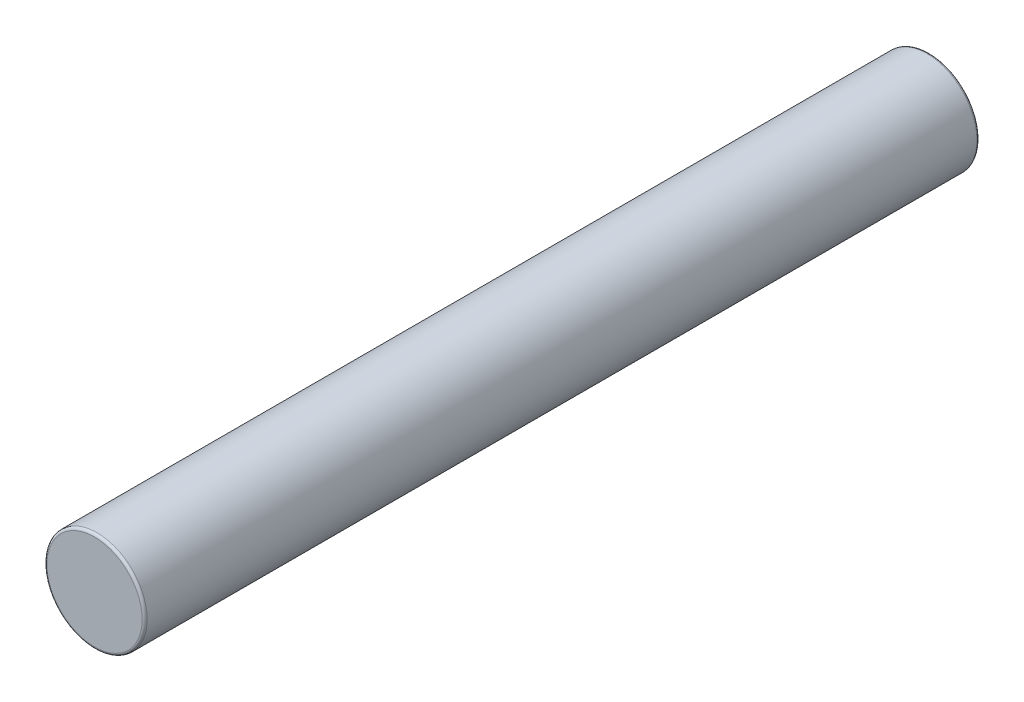
ISO-10303-21;
HEADER;
FILE_DESCRIPTION(('STEP AP214'),'2;1');
FILE_NAME('part.step','',(''),(''),'','','');
FILE_SCHEMA(('AUTOMOTIVE_DESIGN { 1 0 10303 214 1 1 1 1 }'));
ENDSEC;
DATA;
#1=APPLICATION_CONTEXT('core data for automotive mechanical design processes');
#2=APPLICATION_PROTOCOL_DEFINITION('international standard','automotive_design',2000,#1);
#3=PRODUCT_CONTEXT('',#1,'mechanical');
#4=PRODUCT('Part','Part','',(#3));
#5=PRODUCT_RELATED_PRODUCT_CATEGORY('part','',(#4));
#6=PRODUCT_DEFINITION_FORMATION('','',#4);
#7=PRODUCT_DEFINITION_CONTEXT('part definition',#1,'design');
#8=PRODUCT_DEFINITION('design','',#6,#7);
#9=PRODUCT_DEFINITION_SHAPE('','',#8);
#10=(LENGTH_UNIT() NAMED_UNIT(*) SI_UNIT(.MILLI.,.METRE.));
#11=(NAMED_UNIT(*) PLANE_ANGLE_UNIT() SI_UNIT($,.RADIAN.));
#12=(NAMED_UNIT(*) SI_UNIT($,.STERADIAN.) SOLID_ANGLE_UNIT());
#13=UNCERTAINTY_MEASURE_WITH_UNIT(LENGTH_MEASURE(1.E-05),#10,'distance_accuracy_value','');
#14=(GEOMETRIC_REPRESENTATION_CONTEXT(3) GLOBAL_UNCERTAINTY_ASSIGNED_CONTEXT((#13)) GLOBAL_UNIT_ASSIGNED_CONTEXT((#10,
#11,#12)) REPRESENTATION_CONTEXT('',''));
#15=CARTESIAN_POINT('',(0.,0.,0.));
#16=DIRECTION('',(0.,0.,1.));
#17=DIRECTION('',(1.,0.,0.));
#18=AXIS2_PLACEMENT_3D('',#15,#16,#17);
#19=CARTESIAN_POINT('',(0.,0.,-25.));
#20=DIRECTION('',(0.,0.,1.));
#21=DIRECTION('',(1.,0.,0.));
#22=AXIS2_PLACEMENT_3D('',#19,#20,#21);
#23=CYLINDRICAL_SURFACE('',#22,1.5);
#24=CARTESIAN_POINT('',(0.,0.,-0.0749999999999987));
#25=DIRECTION('',(0.,0.,1.));
#26=DIRECTION('',(1.,0.,0.));
#27=AXIS2_PLACEMENT_3D('',#24,#25,#26);
#28=CIRCLE('',#27,1.5);
#29=CARTESIAN_POINT('',(1.5,0.,-0.0749999999999987));
#30=VERTEX_POINT('',#29);
#31=EDGE_CURVE('E47',#30,#30,#28,.F.);
#32=ORIENTED_EDGE('',*,*,#31,.T.);
#33=EDGE_LOOP('',(#32));
#34=FACE_BOUND('',#33,.T.);
#35=CARTESIAN_POINT('',(0.,0.,-24.925));
#36=DIRECTION('',(0.,0.,1.));
#37=DIRECTION('',(1.,0.,0.));
#38=AXIS2_PLACEMENT_3D('',#35,#36,#37);
#39=CIRCLE('',#38,1.5);
#40=CARTESIAN_POINT('',(1.5,0.,-24.925));
#41=VERTEX_POINT('',#40);
#42=EDGE_CURVE('E51',#41,#41,#39,.T.);
#43=ORIENTED_EDGE('',*,*,#42,.T.);
#44=EDGE_LOOP('',(#43));
#45=FACE_BOUND('',#44,.T.);
#46=ADVANCED_FACE('F40',(#34,#45),#23,.T.);
#47=CARTESIAN_POINT('',(0.,0.,-25.));
#48=DIRECTION('',(0.,0.,1.));
#49=DIRECTION('',(1.,0.,0.));
#50=AXIS2_PLACEMENT_3D('',#47,#48,#49);
#51=PLANE('',#50);
#52=CARTESIAN_POINT('',(0.,0.,-25.));
#53=DIRECTION('',(0.,0.,1.));
#54=DIRECTION('',(1.,0.,0.));
#55=AXIS2_PLACEMENT_3D('',#52,#53,#54);
#56=CIRCLE('',#55,1.425);
#57=CARTESIAN_POINT('',(1.425,0.,-25.));
#58=VERTEX_POINT('',#57);
#59=EDGE_CURVE('E10',#58,#58,#56,.F.);
#60=ORIENTED_EDGE('',*,*,#59,.T.);
#61=EDGE_LOOP('',(#60));
#62=FACE_BOUND('',#61,.T.);
#63=ADVANCED_FACE('F71',(#62),#51,.F.);
#64=CARTESIAN_POINT('',(0.,0.,0.));
#65=DIRECTION('',(0.,0.,1.));
#66=DIRECTION('',(1.,0.,0.));
#67=AXIS2_PLACEMENT_3D('',#64,#65,#66);
#68=PLANE('',#67);
#69=CARTESIAN_POINT('',(0.,0.,0.));
#70=DIRECTION('',(0.,0.,1.));
#71=DIRECTION('',(1.,0.,0.));
#72=AXIS2_PLACEMENT_3D('',#69,#70,#71);
#73=CIRCLE('',#72,1.425);
#74=CARTESIAN_POINT('',(1.425,0.,0.));
#75=VERTEX_POINT('',#74);
#76=EDGE_CURVE('E55',#75,#75,#73,.T.);
#77=ORIENTED_EDGE('',*,*,#76,.T.);
#78=EDGE_LOOP('',(#77));
#79=FACE_BOUND('',#78,.T.);
#80=ADVANCED_FACE('F61',(#79),#68,.T.);
#81=CARTESIAN_POINT('',(0.,0.,-0.0749999999999987));
#82=DIRECTION('',(0.,0.,1.));
#83=DIRECTION('',(1.,0.,0.));
#84=AXIS2_PLACEMENT_3D('',#81,#82,#83);
#85=TOROIDAL_SURFACE('',#84,1.425,0.075);
#86=ORIENTED_EDGE('',*,*,#31,.F.);
#87=EDGE_LOOP('',(#86));
#88=FACE_BOUND('',#87,.T.);
#89=ORIENTED_EDGE('',*,*,#76,.F.);
#90=EDGE_LOOP('',(#89));
#91=FACE_BOUND('',#90,.T.);
#92=ADVANCED_FACE('F63',(#88,#91),#85,.T.);
#93=CARTESIAN_POINT('',(0.,0.,-24.925));
#94=DIRECTION('',(0.,0.,1.));
#95=DIRECTION('',(1.,0.,0.));
#96=AXIS2_PLACEMENT_3D('',#93,#94,#95);
#97=TOROIDAL_SURFACE('',#96,1.425,0.075);
#98=ORIENTED_EDGE('',*,*,#59,.F.);
#99=EDGE_LOOP('',(#98));
#100=FACE_BOUND('',#99,.T.);
#101=ORIENTED_EDGE('',*,*,#42,.F.);
#102=EDGE_LOOP('',(#101));
#103=FACE_BOUND('',#102,.T.);
#104=ADVANCED_FACE('F42',(#100,#103),#97,.T.);
#105=CLOSED_SHELL('',(#46,#63,#80,#92,#104));
#106=MANIFOLD_SOLID_BREP('B2',#105);
#107=ADVANCED_BREP_SHAPE_REPRESENTATION('',(#18,#106),#14);
#108=SHAPE_DEFINITION_REPRESENTATION(#9,#107);
ENDSEC;
END-ISO-10303-21;
